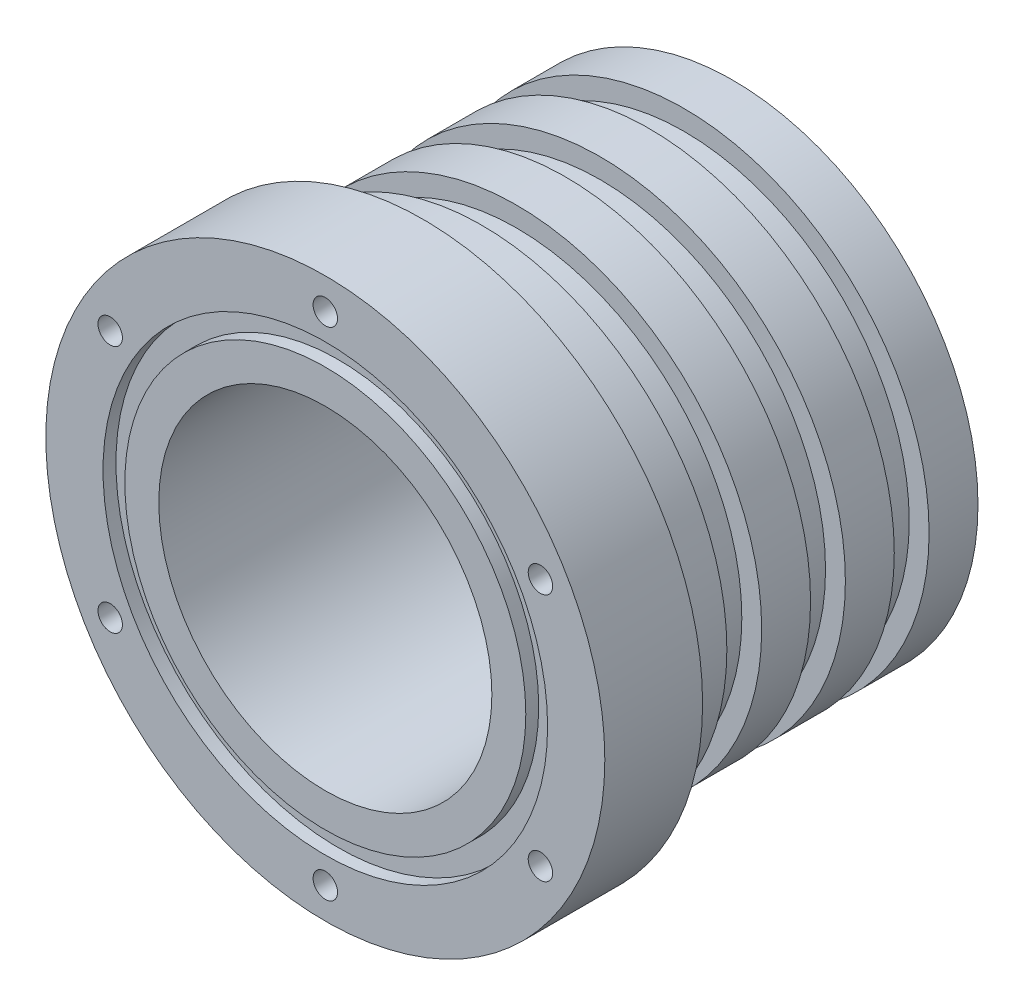
ISO-10303-21;
HEADER;
FILE_DESCRIPTION(('STEP AP214'),'2;1');
FILE_NAME('part.step','',(''),(''),'','','');
FILE_SCHEMA(('AUTOMOTIVE_DESIGN { 1 0 10303 214 1 1 1 1 }'));
ENDSEC;
DATA;
#1=APPLICATION_CONTEXT('core data for automotive mechanical design processes');
#2=APPLICATION_PROTOCOL_DEFINITION('international standard','automotive_design',2000,#1);
#3=PRODUCT_CONTEXT('',#1,'mechanical');
#4=PRODUCT('Part','Part','',(#3));
#5=PRODUCT_RELATED_PRODUCT_CATEGORY('part','',(#4));
#6=PRODUCT_DEFINITION_FORMATION('','',#4);
#7=PRODUCT_DEFINITION_CONTEXT('part definition',#1,'design');
#8=PRODUCT_DEFINITION('design','',#6,#7);
#9=PRODUCT_DEFINITION_SHAPE('','',#8);
#10=(LENGTH_UNIT() NAMED_UNIT(*) SI_UNIT(.MILLI.,.METRE.));
#11=(NAMED_UNIT(*) PLANE_ANGLE_UNIT() SI_UNIT($,.RADIAN.));
#12=(NAMED_UNIT(*) SI_UNIT($,.STERADIAN.) SOLID_ANGLE_UNIT());
#13=UNCERTAINTY_MEASURE_WITH_UNIT(LENGTH_MEASURE(1.E-05),#10,'distance_accuracy_value','');
#14=(GEOMETRIC_REPRESENTATION_CONTEXT(3) GLOBAL_UNCERTAINTY_ASSIGNED_CONTEXT((#13)) GLOBAL_UNIT_ASSIGNED_CONTEXT((#10,
#11,#12)) REPRESENTATION_CONTEXT('',''));
#15=CARTESIAN_POINT('',(0.,0.,0.));
#16=DIRECTION('',(0.,0.,1.));
#17=DIRECTION('',(1.,0.,0.));
#18=AXIS2_PLACEMENT_3D('',#15,#16,#17);
#19=CARTESIAN_POINT('',(-17.03,0.,0.));
#20=DIRECTION('',(0.,0.,-1.));
#21=DIRECTION('',(-1.,0.,0.));
#22=AXIS2_PLACEMENT_3D('',#19,#20,#21);
#23=PLANE('',#22);
#24=CARTESIAN_POINT('',(0.,0.,0.));
#25=DIRECTION('',(0.,0.,1.));
#26=DIRECTION('',(1.,0.,0.));
#27=AXIS2_PLACEMENT_3D('',#24,#25,#26);
#28=CIRCLE('',#27,17.03);
#29=CARTESIAN_POINT('',(17.03,0.,0.));
#30=VERTEX_POINT('',#29);
#31=EDGE_CURVE('E167',#30,#30,#28,.T.);
#32=ORIENTED_EDGE('',*,*,#31,.F.);
#33=EDGE_LOOP('',(#32));
#34=FACE_BOUND('',#33,.T.);
#35=CARTESIAN_POINT('',(0.,0.,0.));
#36=DIRECTION('',(0.,0.,1.));
#37=DIRECTION('',(1.,0.,0.));
#38=AXIS2_PLACEMENT_3D('',#35,#36,#37);
#39=CIRCLE('',#38,20.5);
#40=CARTESIAN_POINT('',(20.5,0.,0.));
#41=VERTEX_POINT('',#40);
#42=EDGE_CURVE('E250',#41,#41,#39,.T.);
#43=ORIENTED_EDGE('',*,*,#42,.T.);
#44=EDGE_LOOP('',(#43));
#45=FACE_BOUND('',#44,.T.);
#46=ADVANCED_FACE('F36',(#34,#45),#23,.F.);
#47=CARTESIAN_POINT('',(0.,0.,0.));
#48=DIRECTION('',(0.,0.,1.));
#49=DIRECTION('',(1.,0.,0.));
#50=AXIS2_PLACEMENT_3D('',#47,#48,#49);
#51=CIRCLE('',#50,22.73);
#52=CARTESIAN_POINT('',(22.73,0.,0.));
#53=VERTEX_POINT('',#52);
#54=EDGE_CURVE('E255',#53,#53,#51,.T.);
#55=ORIENTED_EDGE('',*,*,#54,.F.);
#56=EDGE_LOOP('',(#55));
#57=FACE_BOUND('',#56,.T.);
#58=CARTESIAN_POINT('',(0.,25.4,0.));
#59=DIRECTION('',(0.,0.,1.));
#60=DIRECTION('',(1.,0.,0.));
#61=AXIS2_PLACEMENT_3D('',#58,#59,#60);
#62=CIRCLE('',#61,1.24999999999999);
#63=CARTESIAN_POINT('',(1.24999999999999,25.4,0.));
#64=VERTEX_POINT('',#63);
#65=EDGE_CURVE('E96',#64,#64,#62,.T.);
#66=ORIENTED_EDGE('',*,*,#65,.F.);
#67=EDGE_LOOP('',(#66));
#68=FACE_BOUND('',#67,.T.);
#69=CARTESIAN_POINT('',(21.9970452561281,12.7000000000059,0.));
#70=DIRECTION('',(0.,0.,1.));
#71=DIRECTION('',(1.,0.,0.));
#72=AXIS2_PLACEMENT_3D('',#69,#70,#71);
#73=CIRCLE('',#72,1.24999999999999);
#74=CARTESIAN_POINT('',(23.2470452561281,12.7000000000059,0.));
#75=VERTEX_POINT('',#74);
#76=EDGE_CURVE('E95',#75,#75,#73,.T.);
#77=ORIENTED_EDGE('',*,*,#76,.F.);
#78=EDGE_LOOP('',(#77));
#79=FACE_BOUND('',#78,.T.);
#80=CARTESIAN_POINT('',(21.9970452561349,-12.6999999999941,0.));
#81=DIRECTION('',(0.,0.,1.));
#82=DIRECTION('',(1.,0.,0.));
#83=AXIS2_PLACEMENT_3D('',#80,#81,#82);
#84=CIRCLE('',#83,1.24999999999999);
#85=CARTESIAN_POINT('',(23.2470452561349,-12.6999999999941,0.));
#86=VERTEX_POINT('',#85);
#87=EDGE_CURVE('E268',#86,#86,#84,.T.);
#88=ORIENTED_EDGE('',*,*,#87,.F.);
#89=EDGE_LOOP('',(#88));
#90=FACE_BOUND('',#89,.T.);
#91=CARTESIAN_POINT('',(1.35308431126191E-11,-25.4,0.));
#92=DIRECTION('',(0.,0.,1.));
#93=DIRECTION('',(1.,0.,0.));
#94=AXIS2_PLACEMENT_3D('',#91,#92,#93);
#95=CIRCLE('',#94,1.24999999999999);
#96=CARTESIAN_POINT('',(1.25000000001352,-25.4,0.));
#97=VERTEX_POINT('',#96);
#98=EDGE_CURVE('E273',#97,#97,#95,.T.);
#99=ORIENTED_EDGE('',*,*,#98,.F.);
#100=EDGE_LOOP('',(#99));
#101=FACE_BOUND('',#100,.T.);
#102=CARTESIAN_POINT('',(-21.9970452561146,-12.7000000000059,0.));
#103=DIRECTION('',(0.,0.,1.));
#104=DIRECTION('',(1.,0.,0.));
#105=AXIS2_PLACEMENT_3D('',#102,#103,#104);
#106=CIRCLE('',#105,1.24999999999999);
#107=CARTESIAN_POINT('',(-20.7470452561146,-12.7000000000059,0.));
#108=VERTEX_POINT('',#107);
#109=EDGE_CURVE('E278',#108,#108,#106,.T.);
#110=ORIENTED_EDGE('',*,*,#109,.F.);
#111=EDGE_LOOP('',(#110));
#112=FACE_BOUND('',#111,.T.);
#113=CARTESIAN_POINT('',(-21.9970452561214,12.6999999999941,0.));
#114=DIRECTION('',(0.,0.,1.));
#115=DIRECTION('',(1.,0.,0.));
#116=AXIS2_PLACEMENT_3D('',#113,#114,#115);
#117=CIRCLE('',#116,1.24999999999999);
#118=CARTESIAN_POINT('',(-20.7470452561214,12.6999999999941,0.));
#119=VERTEX_POINT('',#118);
#120=EDGE_CURVE('E168',#119,#119,#117,.T.);
#121=ORIENTED_EDGE('',*,*,#120,.F.);
#122=EDGE_LOOP('',(#121));
#123=FACE_BOUND('',#122,.T.);
#124=CARTESIAN_POINT('',(0.,0.,0.));
#125=DIRECTION('',(0.,0.,1.));
#126=DIRECTION('',(1.,0.,0.));
#127=AXIS2_PLACEMENT_3D('',#124,#125,#126);
#128=CIRCLE('',#127,28.58);
#129=CARTESIAN_POINT('',(28.58,0.,0.));
#130=VERTEX_POINT('',#129);
#131=EDGE_CURVE('E122',#130,#130,#128,.T.);
#132=ORIENTED_EDGE('',*,*,#131,.T.);
#133=EDGE_LOOP('',(#132));
#134=FACE_BOUND('',#133,.T.);
#135=ADVANCED_FACE('F38',(#57,#68,#79,#90,#101,#112,#123,#134),#23,.F.);
#136=CARTESIAN_POINT('',(0.,0.,0.));
#137=DIRECTION('',(0.,0.,1.));
#138=DIRECTION('',(1.,0.,0.));
#139=AXIS2_PLACEMENT_3D('',#136,#137,#138);
#140=CYLINDRICAL_SURFACE('',#139,28.58);
#141=ORIENTED_EDGE('',*,*,#131,.F.);
#142=EDGE_LOOP('',(#141));
#143=FACE_BOUND('',#142,.T.);
#144=CARTESIAN_POINT('',(0.,0.,-10.));
#145=DIRECTION('',(0.,0.,1.));
#146=DIRECTION('',(1.,0.,0.));
#147=AXIS2_PLACEMENT_3D('',#144,#145,#146);
#148=CIRCLE('',#147,28.58);
#149=CARTESIAN_POINT('',(28.58,0.,-10.));
#150=VERTEX_POINT('',#149);
#151=EDGE_CURVE('E116',#150,#150,#148,.T.);
#152=ORIENTED_EDGE('',*,*,#151,.T.);
#153=EDGE_LOOP('',(#152));
#154=FACE_BOUND('',#153,.T.);
#155=ADVANCED_FACE('F227',(#143,#154),#140,.T.);
#156=CARTESIAN_POINT('',(-28.58,0.,-9.99999999999999));
#157=DIRECTION('',(0.,0.,1.));
#158=DIRECTION('',(1.,0.,0.));
#159=AXIS2_PLACEMENT_3D('',#156,#157,#158);
#160=PLANE('',#159);
#161=ORIENTED_EDGE('',*,*,#151,.F.);
#162=EDGE_LOOP('',(#161));
#163=FACE_BOUND('',#162,.T.);
#164=CARTESIAN_POINT('',(0.,0.,-9.99999999999999));
#165=DIRECTION('',(0.,0.,1.));
#166=DIRECTION('',(1.,0.,0.));
#167=AXIS2_PLACEMENT_3D('',#164,#165,#166);
#168=CIRCLE('',#167,25.06);
#169=CARTESIAN_POINT('',(21.080703143895,13.5501865285677,-9.99999999999999));
#170=VERTEX_POINT('',#169);
#171=CARTESIAN_POINT('',(1.19445418780827,25.0315177165354,-9.99999999999999));
#172=VERTEX_POINT('',#171);
#173=EDGE_CURVE('E104',#170,#172,#168,.T.);
#174=ORIENTED_EDGE('',*,*,#173,.T.);
#175=CARTESIAN_POINT('',(0.,25.4,-9.99999999999999));
#176=DIRECTION('',(0.,0.,1.));
#177=DIRECTION('',(1.,0.,0.));
#178=AXIS2_PLACEMENT_3D('',#175,#176,#177);
#179=CIRCLE('',#178,1.24999999999999);
#180=CARTESIAN_POINT('',(-1.19445418780825,25.0315177165354,-9.99999999999999));
#181=VERTEX_POINT('',#180);
#182=EDGE_CURVE('E11',#172,#181,#179,.T.);
#183=ORIENTED_EDGE('',*,*,#182,.T.);
#184=CARTESIAN_POINT('',(-21.0807031438966,13.5501865285651,-9.99999999999999));
#185=VERTEX_POINT('',#184);
#186=EDGE_CURVE('E105',#181,#185,#168,.T.);
#187=ORIENTED_EDGE('',*,*,#186,.T.);
#188=CARTESIAN_POINT('',(-21.9970452561214,12.6999999999941,-9.99999999999999));
#189=DIRECTION('',(0.,0.,1.));
#190=DIRECTION('',(1.,0.,0.));
#191=AXIS2_PLACEMENT_3D('',#188,#189,#190);
#192=CIRCLE('',#191,1.24999999999999);
#193=CARTESIAN_POINT('',(-22.2751573317064,11.4813311879645,-9.99999999999999));
#194=VERTEX_POINT('',#193);
#195=EDGE_CURVE('E125',#185,#194,#192,.T.);
#196=ORIENTED_EDGE('',*,*,#195,.T.);
#197=CARTESIAN_POINT('',(-22.2751573317003,-11.4813311879764,-9.99999999999999));
#198=VERTEX_POINT('',#197);
#199=EDGE_CURVE('E117',#194,#198,#168,.T.);
#200=ORIENTED_EDGE('',*,*,#199,.T.);
#201=CARTESIAN_POINT('',(-21.9970452561146,-12.7000000000059,-9.99999999999999));
#202=DIRECTION('',(0.,0.,1.));
#203=DIRECTION('',(1.,0.,0.));
#204=AXIS2_PLACEMENT_3D('',#201,#202,#203);
#205=CIRCLE('',#204,1.24999999999999);
#206=CARTESIAN_POINT('',(-21.0807031438894,-13.5501865285763,-9.99999999999999));
#207=VERTEX_POINT('',#206);
#208=EDGE_CURVE('E128',#198,#207,#205,.T.);
#209=ORIENTED_EDGE('',*,*,#208,.T.);
#210=CARTESIAN_POINT('',(-1.19445418779494,-25.0315177165361,-9.99999999999999));
#211=VERTEX_POINT('',#210);
#212=EDGE_CURVE('E148',#207,#211,#168,.T.);
#213=ORIENTED_EDGE('',*,*,#212,.T.);
#214=CARTESIAN_POINT('',(1.35308431126191E-11,-25.4,-9.99999999999999));
#215=DIRECTION('',(0.,0.,1.));
#216=DIRECTION('',(1.,0.,0.));
#217=AXIS2_PLACEMENT_3D('',#214,#215,#216);
#218=CIRCLE('',#217,1.24999999999999);
#219=CARTESIAN_POINT('',(1.19445418782159,-25.0315177165348,-9.99999999999999));
#220=VERTEX_POINT('',#219);
#221=EDGE_CURVE('E131',#211,#220,#218,.T.);
#222=ORIENTED_EDGE('',*,*,#221,.T.);
#223=CARTESIAN_POINT('',(21.0807031439022,-13.5501865285565,-9.99999999999999));
#224=VERTEX_POINT('',#223);
#225=EDGE_CURVE('E139',#220,#224,#168,.T.);
#226=ORIENTED_EDGE('',*,*,#225,.T.);
#227=CARTESIAN_POINT('',(21.9970452561349,-12.6999999999941,-9.99999999999999));
#228=DIRECTION('',(0.,0.,1.));
#229=DIRECTION('',(1.,0.,0.));
#230=AXIS2_PLACEMENT_3D('',#227,#228,#229);
#231=CIRCLE('',#230,1.24999999999999);
#232=CARTESIAN_POINT('',(22.2751573317078,-11.4813311879618,-9.99999999999999));
#233=VERTEX_POINT('',#232);
#234=EDGE_CURVE('E134',#224,#233,#231,.T.);
#235=ORIENTED_EDGE('',*,*,#234,.T.);
#236=CARTESIAN_POINT('',(22.2751573317017,11.4813311879736,-9.99999999999999));
#237=VERTEX_POINT('',#236);
#238=EDGE_CURVE('E111',#233,#237,#168,.T.);
#239=ORIENTED_EDGE('',*,*,#238,.T.);
#240=CARTESIAN_POINT('',(21.9970452561281,12.7000000000059,-9.99999999999999));
#241=DIRECTION('',(0.,0.,1.));
#242=DIRECTION('',(1.,0.,0.));
#243=AXIS2_PLACEMENT_3D('',#240,#241,#242);
#244=CIRCLE('',#243,1.24999999999999);
#245=EDGE_CURVE('E44',#237,#170,#244,.T.);
#246=ORIENTED_EDGE('',*,*,#245,.T.);
#247=EDGE_LOOP('',(#174,#183,#187,#196,#200,#209,#213,#222,#226,#235,#239,#246));
#248=FACE_BOUND('',#247,.T.);
#249=ADVANCED_FACE('F108',(#163,#248),#160,.F.);
#250=CARTESIAN_POINT('',(0.,0.,0.));
#251=DIRECTION('',(0.,0.,1.));
#252=DIRECTION('',(1.,0.,0.));
#253=AXIS2_PLACEMENT_3D('',#250,#251,#252);
#254=CYLINDRICAL_SURFACE('',#253,25.06);
#255=EDGE_CURVE('E112',#185,#194,#168,.T.);
#256=ORIENTED_EDGE('',*,*,#255,.F.);
#257=ORIENTED_EDGE('',*,*,#186,.F.);
#258=EDGE_CURVE('E94',#172,#181,#168,.T.);
#259=ORIENTED_EDGE('',*,*,#258,.F.);
#260=ORIENTED_EDGE('',*,*,#173,.F.);
#261=EDGE_CURVE('E110',#237,#170,#168,.T.);
#262=ORIENTED_EDGE('',*,*,#261,.F.);
#263=ORIENTED_EDGE('',*,*,#238,.F.);
#264=EDGE_CURVE('E144',#224,#233,#168,.T.);
#265=ORIENTED_EDGE('',*,*,#264,.F.);
#266=ORIENTED_EDGE('',*,*,#225,.F.);
#267=EDGE_CURVE('E146',#211,#220,#168,.T.);
#268=ORIENTED_EDGE('',*,*,#267,.F.);
#269=ORIENTED_EDGE('',*,*,#212,.F.);
#270=EDGE_CURVE('E153',#198,#207,#168,.T.);
#271=ORIENTED_EDGE('',*,*,#270,.F.);
#272=ORIENTED_EDGE('',*,*,#199,.F.);
#273=EDGE_LOOP('',(#256,#257,#259,#260,#262,#263,#265,#266,#268,#269,#271,#272));
#274=FACE_BOUND('',#273,.T.);
#275=CARTESIAN_POINT('',(0.,0.,-16.));
#276=DIRECTION('',(0.,0.,1.));
#277=DIRECTION('',(1.,0.,0.));
#278=AXIS2_PLACEMENT_3D('',#275,#276,#277);
#279=CIRCLE('',#278,25.06);
#280=CARTESIAN_POINT('',(25.06,0.,-16.));
#281=VERTEX_POINT('',#280);
#282=EDGE_CURVE('E118',#281,#281,#279,.T.);
#283=ORIENTED_EDGE('',*,*,#282,.T.);
#284=EDGE_LOOP('',(#283));
#285=FACE_BOUND('',#284,.T.);
#286=ADVANCED_FACE('F101',(#274,#285),#254,.T.);
#287=CARTESIAN_POINT('',(-25.06,0.,-16.));
#288=DIRECTION('',(0.,0.,1.));
#289=DIRECTION('',(1.,0.,0.));
#290=AXIS2_PLACEMENT_3D('',#287,#288,#289);
#291=PLANE('',#290);
#292=ORIENTED_EDGE('',*,*,#282,.F.);
#293=EDGE_LOOP('',(#292));
#294=FACE_BOUND('',#293,.T.);
#295=CARTESIAN_POINT('',(0.,0.,-16.));
#296=DIRECTION('',(0.,0.,1.));
#297=DIRECTION('',(1.,0.,0.));
#298=AXIS2_PLACEMENT_3D('',#295,#296,#297);
#299=CIRCLE('',#298,23.03);
#300=CARTESIAN_POINT('',(23.03,0.,-16.));
#301=VERTEX_POINT('',#300);
#302=EDGE_CURVE('E212',#301,#301,#299,.T.);
#303=ORIENTED_EDGE('',*,*,#302,.T.);
#304=EDGE_LOOP('',(#303));
#305=FACE_BOUND('',#304,.T.);
#306=ADVANCED_FACE('F240',(#294,#305),#291,.F.);
#307=CARTESIAN_POINT('',(0.,0.,0.));
#308=DIRECTION('',(0.,0.,1.));
#309=DIRECTION('',(1.,0.,0.));
#310=AXIS2_PLACEMENT_3D('',#307,#308,#309);
#311=CYLINDRICAL_SURFACE('',#310,23.03);
#312=ORIENTED_EDGE('',*,*,#302,.F.);
#313=EDGE_LOOP('',(#312));
#314=FACE_BOUND('',#313,.T.);
#315=CARTESIAN_POINT('',(0.,0.,-19.56));
#316=DIRECTION('',(0.,0.,1.));
#317=DIRECTION('',(1.,0.,0.));
#318=AXIS2_PLACEMENT_3D('',#315,#316,#317);
#319=CIRCLE('',#318,23.03);
#320=CARTESIAN_POINT('',(23.03,0.,-19.56));
#321=VERTEX_POINT('',#320);
#322=EDGE_CURVE('E210',#321,#321,#319,.T.);
#323=ORIENTED_EDGE('',*,*,#322,.T.);
#324=EDGE_LOOP('',(#323));
#325=FACE_BOUND('',#324,.T.);
#326=ADVANCED_FACE('F343',(#314,#325),#311,.T.);
#327=CARTESIAN_POINT('',(-23.03,0.,-19.56));
#328=DIRECTION('',(0.,0.,-1.));
#329=DIRECTION('',(-1.,0.,0.));
#330=AXIS2_PLACEMENT_3D('',#327,#328,#329);
#331=PLANE('',#330);
#332=ORIENTED_EDGE('',*,*,#322,.F.);
#333=EDGE_LOOP('',(#332));
#334=FACE_BOUND('',#333,.T.);
#335=CARTESIAN_POINT('',(0.,0.,-19.56));
#336=DIRECTION('',(0.,0.,1.));
#337=DIRECTION('',(1.,0.,0.));
#338=AXIS2_PLACEMENT_3D('',#335,#336,#337);
#339=CIRCLE('',#338,25.06);
#340=CARTESIAN_POINT('',(25.06,0.,-19.56));
#341=VERTEX_POINT('',#340);
#342=EDGE_CURVE('E207',#341,#341,#339,.T.);
#343=ORIENTED_EDGE('',*,*,#342,.T.);
#344=EDGE_LOOP('',(#343));
#345=FACE_BOUND('',#344,.T.);
#346=ADVANCED_FACE('F339',(#334,#345),#331,.F.);
#347=CARTESIAN_POINT('',(0.,0.,0.));
#348=DIRECTION('',(0.,0.,1.));
#349=DIRECTION('',(1.,0.,0.));
#350=AXIS2_PLACEMENT_3D('',#347,#348,#349);
#351=CYLINDRICAL_SURFACE('',#350,25.06);
#352=ORIENTED_EDGE('',*,*,#342,.F.);
#353=EDGE_LOOP('',(#352));
#354=FACE_BOUND('',#353,.T.);
#355=CARTESIAN_POINT('',(0.,0.,-24.56));
#356=DIRECTION('',(0.,0.,1.));
#357=DIRECTION('',(1.,0.,0.));
#358=AXIS2_PLACEMENT_3D('',#355,#356,#357);
#359=CIRCLE('',#358,25.06);
#360=CARTESIAN_POINT('',(25.06,0.,-24.56));
#361=VERTEX_POINT('',#360);
#362=EDGE_CURVE('E204',#361,#361,#359,.T.);
#363=ORIENTED_EDGE('',*,*,#362,.T.);
#364=EDGE_LOOP('',(#363));
#365=FACE_BOUND('',#364,.T.);
#366=ADVANCED_FACE('F335',(#354,#365),#351,.T.);
#367=CARTESIAN_POINT('',(-25.06,0.,-24.56));
#368=DIRECTION('',(0.,0.,1.));
#369=DIRECTION('',(1.,0.,0.));
#370=AXIS2_PLACEMENT_3D('',#367,#368,#369);
#371=PLANE('',#370);
#372=ORIENTED_EDGE('',*,*,#362,.F.);
#373=EDGE_LOOP('',(#372));
#374=FACE_BOUND('',#373,.T.);
#375=CARTESIAN_POINT('',(0.,0.,-24.56));
#376=DIRECTION('',(0.,0.,1.));
#377=DIRECTION('',(1.,0.,0.));
#378=AXIS2_PLACEMENT_3D('',#375,#376,#377);
#379=CIRCLE('',#378,23.03);
#380=CARTESIAN_POINT('',(23.03,0.,-24.56));
#381=VERTEX_POINT('',#380);
#382=EDGE_CURVE('E201',#381,#381,#379,.T.);
#383=ORIENTED_EDGE('',*,*,#382,.T.);
#384=EDGE_LOOP('',(#383));
#385=FACE_BOUND('',#384,.T.);
#386=ADVANCED_FACE('F331',(#374,#385),#371,.F.);
#387=CARTESIAN_POINT('',(0.,0.,0.));
#388=DIRECTION('',(0.,0.,1.));
#389=DIRECTION('',(1.,0.,0.));
#390=AXIS2_PLACEMENT_3D('',#387,#388,#389);
#391=CYLINDRICAL_SURFACE('',#390,23.03);
#392=ORIENTED_EDGE('',*,*,#382,.F.);
#393=EDGE_LOOP('',(#392));
#394=FACE_BOUND('',#393,.T.);
#395=CARTESIAN_POINT('',(0.,0.,-28.12));
#396=DIRECTION('',(0.,0.,1.));
#397=DIRECTION('',(1.,0.,0.));
#398=AXIS2_PLACEMENT_3D('',#395,#396,#397);
#399=CIRCLE('',#398,23.03);
#400=CARTESIAN_POINT('',(23.03,0.,-28.12));
#401=VERTEX_POINT('',#400);
#402=EDGE_CURVE('E198',#401,#401,#399,.T.);
#403=ORIENTED_EDGE('',*,*,#402,.T.);
#404=EDGE_LOOP('',(#403));
#405=FACE_BOUND('',#404,.T.);
#406=ADVANCED_FACE('F327',(#394,#405),#391,.T.);
#407=CARTESIAN_POINT('',(-23.03,0.,-28.12));
#408=DIRECTION('',(0.,0.,-1.));
#409=DIRECTION('',(-1.,0.,0.));
#410=AXIS2_PLACEMENT_3D('',#407,#408,#409);
#411=PLANE('',#410);
#412=ORIENTED_EDGE('',*,*,#402,.F.);
#413=EDGE_LOOP('',(#412));
#414=FACE_BOUND('',#413,.T.);
#415=CARTESIAN_POINT('',(0.,0.,-28.12));
#416=DIRECTION('',(0.,0.,1.));
#417=DIRECTION('',(1.,0.,0.));
#418=AXIS2_PLACEMENT_3D('',#415,#416,#417);
#419=CIRCLE('',#418,25.06);
#420=CARTESIAN_POINT('',(25.06,0.,-28.12));
#421=VERTEX_POINT('',#420);
#422=EDGE_CURVE('E195',#421,#421,#419,.T.);
#423=ORIENTED_EDGE('',*,*,#422,.T.);
#424=EDGE_LOOP('',(#423));
#425=FACE_BOUND('',#424,.T.);
#426=ADVANCED_FACE('F323',(#414,#425),#411,.F.);
#427=CARTESIAN_POINT('',(0.,0.,0.));
#428=DIRECTION('',(0.,0.,1.));
#429=DIRECTION('',(1.,0.,0.));
#430=AXIS2_PLACEMENT_3D('',#427,#428,#429);
#431=CYLINDRICAL_SURFACE('',#430,25.06);
#432=ORIENTED_EDGE('',*,*,#422,.F.);
#433=EDGE_LOOP('',(#432));
#434=FACE_BOUND('',#433,.T.);
#435=CARTESIAN_POINT('',(0.,0.,-33.12));
#436=DIRECTION('',(0.,0.,1.));
#437=DIRECTION('',(1.,0.,0.));
#438=AXIS2_PLACEMENT_3D('',#435,#436,#437);
#439=CIRCLE('',#438,25.06);
#440=CARTESIAN_POINT('',(25.06,0.,-33.12));
#441=VERTEX_POINT('',#440);
#442=EDGE_CURVE('E192',#441,#441,#439,.T.);
#443=ORIENTED_EDGE('',*,*,#442,.T.);
#444=EDGE_LOOP('',(#443));
#445=FACE_BOUND('',#444,.T.);
#446=ADVANCED_FACE('F319',(#434,#445),#431,.T.);
#447=CARTESIAN_POINT('',(-25.06,0.,-33.12));
#448=DIRECTION('',(0.,0.,1.));
#449=DIRECTION('',(1.,0.,0.));
#450=AXIS2_PLACEMENT_3D('',#447,#448,#449);
#451=PLANE('',#450);
#452=ORIENTED_EDGE('',*,*,#442,.F.);
#453=EDGE_LOOP('',(#452));
#454=FACE_BOUND('',#453,.T.);
#455=CARTESIAN_POINT('',(0.,0.,-33.12));
#456=DIRECTION('',(0.,0.,1.));
#457=DIRECTION('',(1.,0.,0.));
#458=AXIS2_PLACEMENT_3D('',#455,#456,#457);
#459=CIRCLE('',#458,23.03);
#460=CARTESIAN_POINT('',(23.03,0.,-33.12));
#461=VERTEX_POINT('',#460);
#462=EDGE_CURVE('E189',#461,#461,#459,.T.);
#463=ORIENTED_EDGE('',*,*,#462,.T.);
#464=EDGE_LOOP('',(#463));
#465=FACE_BOUND('',#464,.T.);
#466=ADVANCED_FACE('F315',(#454,#465),#451,.F.);
#467=CARTESIAN_POINT('',(0.,0.,0.));
#468=DIRECTION('',(0.,0.,1.));
#469=DIRECTION('',(1.,0.,0.));
#470=AXIS2_PLACEMENT_3D('',#467,#468,#469);
#471=CYLINDRICAL_SURFACE('',#470,23.03);
#472=ORIENTED_EDGE('',*,*,#462,.F.);
#473=EDGE_LOOP('',(#472));
#474=FACE_BOUND('',#473,.T.);
#475=CARTESIAN_POINT('',(0.,0.,-36.68));
#476=DIRECTION('',(0.,0.,1.));
#477=DIRECTION('',(1.,0.,0.));
#478=AXIS2_PLACEMENT_3D('',#475,#476,#477);
#479=CIRCLE('',#478,23.03);
#480=CARTESIAN_POINT('',(23.03,0.,-36.68));
#481=VERTEX_POINT('',#480);
#482=EDGE_CURVE('E186',#481,#481,#479,.T.);
#483=ORIENTED_EDGE('',*,*,#482,.T.);
#484=EDGE_LOOP('',(#483));
#485=FACE_BOUND('',#484,.T.);
#486=ADVANCED_FACE('F311',(#474,#485),#471,.T.);
#487=CARTESIAN_POINT('',(-23.03,0.,-36.68));
#488=DIRECTION('',(0.,0.,-1.));
#489=DIRECTION('',(-1.,0.,0.));
#490=AXIS2_PLACEMENT_3D('',#487,#488,#489);
#491=PLANE('',#490);
#492=ORIENTED_EDGE('',*,*,#482,.F.);
#493=EDGE_LOOP('',(#492));
#494=FACE_BOUND('',#493,.T.);
#495=CARTESIAN_POINT('',(0.,0.,-36.68));
#496=DIRECTION('',(0.,0.,1.));
#497=DIRECTION('',(1.,0.,0.));
#498=AXIS2_PLACEMENT_3D('',#495,#496,#497);
#499=CIRCLE('',#498,25.06);
#500=CARTESIAN_POINT('',(25.06,0.,-36.68));
#501=VERTEX_POINT('',#500);
#502=EDGE_CURVE('E183',#501,#501,#499,.T.);
#503=ORIENTED_EDGE('',*,*,#502,.T.);
#504=EDGE_LOOP('',(#503));
#505=FACE_BOUND('',#504,.T.);
#506=ADVANCED_FACE('F307',(#494,#505),#491,.F.);
#507=CARTESIAN_POINT('',(0.,0.,0.));
#508=DIRECTION('',(0.,0.,1.));
#509=DIRECTION('',(1.,0.,0.));
#510=AXIS2_PLACEMENT_3D('',#507,#508,#509);
#511=CYLINDRICAL_SURFACE('',#510,25.06);
#512=ORIENTED_EDGE('',*,*,#502,.F.);
#513=EDGE_LOOP('',(#512));
#514=FACE_BOUND('',#513,.T.);
#515=CARTESIAN_POINT('',(0.,0.,-41.68));
#516=DIRECTION('',(0.,0.,1.));
#517=DIRECTION('',(1.,0.,0.));
#518=AXIS2_PLACEMENT_3D('',#515,#516,#517);
#519=CIRCLE('',#518,25.06);
#520=CARTESIAN_POINT('',(25.06,0.,-41.68));
#521=VERTEX_POINT('',#520);
#522=EDGE_CURVE('E180',#521,#521,#519,.T.);
#523=ORIENTED_EDGE('',*,*,#522,.T.);
#524=EDGE_LOOP('',(#523));
#525=FACE_BOUND('',#524,.T.);
#526=ADVANCED_FACE('F303',(#514,#525),#511,.T.);
#527=CARTESIAN_POINT('',(-25.06,0.,-41.68));
#528=DIRECTION('',(0.,0.,1.));
#529=DIRECTION('',(1.,0.,0.));
#530=AXIS2_PLACEMENT_3D('',#527,#528,#529);
#531=PLANE('',#530);
#532=ORIENTED_EDGE('',*,*,#522,.F.);
#533=EDGE_LOOP('',(#532));
#534=FACE_BOUND('',#533,.T.);
#535=CARTESIAN_POINT('',(0.,0.,-41.68));
#536=DIRECTION('',(0.,0.,1.));
#537=DIRECTION('',(1.,0.,0.));
#538=AXIS2_PLACEMENT_3D('',#535,#536,#537);
#539=CIRCLE('',#538,17.03);
#540=CARTESIAN_POINT('',(17.03,0.,-41.68));
#541=VERTEX_POINT('',#540);
#542=EDGE_CURVE('E171',#541,#541,#539,.T.);
#543=ORIENTED_EDGE('',*,*,#542,.T.);
#544=EDGE_LOOP('',(#543));
#545=FACE_BOUND('',#544,.T.);
#546=ADVANCED_FACE('F299',(#534,#545),#531,.F.);
#547=CARTESIAN_POINT('',(0.,0.,0.));
#548=DIRECTION('',(0.,0.,1.));
#549=DIRECTION('',(1.,0.,0.));
#550=AXIS2_PLACEMENT_3D('',#547,#548,#549);
#551=CYLINDRICAL_SURFACE('',#550,17.03);
#552=ORIENTED_EDGE('',*,*,#542,.F.);
#553=EDGE_LOOP('',(#552));
#554=FACE_BOUND('',#553,.T.);
#555=ORIENTED_EDGE('',*,*,#31,.T.);
#556=EDGE_LOOP('',(#555));
#557=FACE_BOUND('',#556,.T.);
#558=ADVANCED_FACE('F295',(#554,#557),#551,.F.);
#559=CARTESIAN_POINT('',(-28.58,0.,-9.99999999999999));
#560=DIRECTION('',(0.,0.,1.));
#561=DIRECTION('',(1.,0.,0.));
#562=AXIS2_PLACEMENT_3D('',#559,#560,#561);
#563=PLANE('',#562);
#564=ORIENTED_EDGE('',*,*,#255,.T.);
#565=CARTESIAN_POINT('',(-21.9970452561214,12.6999999999941,-9.99999999999999));
#566=DIRECTION('',(0.,0.,1.));
#567=DIRECTION('',(1.,0.,0.));
#568=AXIS2_PLACEMENT_3D('',#565,#566,#567);
#569=CIRCLE('',#568,1.24999999999999);
#570=EDGE_CURVE('E165',#185,#194,#569,.F.);
#571=ORIENTED_EDGE('',*,*,#570,.F.);
#572=EDGE_LOOP('',(#564,#571));
#573=FACE_BOUND('',#572,.T.);
#574=ADVANCED_FACE('F164',(#573),#563,.T.);
#575=CARTESIAN_POINT('',(-21.9970452561214,12.6999999999941,0.));
#576=DIRECTION('',(0.,0.,1.));
#577=DIRECTION('',(1.,0.,0.));
#578=AXIS2_PLACEMENT_3D('',#575,#576,#577);
#579=CYLINDRICAL_SURFACE('',#578,1.24999999999999);
#580=ORIENTED_EDGE('',*,*,#570,.T.);
#581=ORIENTED_EDGE('',*,*,#195,.F.);
#582=EDGE_LOOP('',(#580,#581));
#583=FACE_BOUND('',#582,.T.);
#584=ORIENTED_EDGE('',*,*,#120,.T.);
#585=EDGE_LOOP('',(#584));
#586=FACE_BOUND('',#585,.T.);
#587=ADVANCED_FACE('F218',(#583,#586),#579,.F.);
#588=CARTESIAN_POINT('',(-28.58,0.,-9.99999999999999));
#589=DIRECTION('',(0.,0.,1.));
#590=DIRECTION('',(1.,0.,0.));
#591=AXIS2_PLACEMENT_3D('',#588,#589,#590);
#592=PLANE('',#591);
#593=ORIENTED_EDGE('',*,*,#270,.T.);
#594=CARTESIAN_POINT('',(-21.9970452561146,-12.7000000000059,-9.99999999999999));
#595=DIRECTION('',(0.,0.,1.));
#596=DIRECTION('',(1.,0.,0.));
#597=AXIS2_PLACEMENT_3D('',#594,#595,#596);
#598=CIRCLE('',#597,1.24999999999999);
#599=EDGE_CURVE('E174',#198,#207,#598,.F.);
#600=ORIENTED_EDGE('',*,*,#599,.F.);
#601=EDGE_LOOP('',(#593,#600));
#602=FACE_BOUND('',#601,.T.);
#603=ADVANCED_FACE('F221',(#602),#592,.T.);
#604=CARTESIAN_POINT('',(-21.9970452561146,-12.7000000000059,0.));
#605=DIRECTION('',(0.,0.,1.));
#606=DIRECTION('',(1.,0.,0.));
#607=AXIS2_PLACEMENT_3D('',#604,#605,#606);
#608=CYLINDRICAL_SURFACE('',#607,1.24999999999999);
#609=ORIENTED_EDGE('',*,*,#599,.T.);
#610=ORIENTED_EDGE('',*,*,#208,.F.);
#611=EDGE_LOOP('',(#609,#610));
#612=FACE_BOUND('',#611,.T.);
#613=ORIENTED_EDGE('',*,*,#109,.T.);
#614=EDGE_LOOP('',(#613));
#615=FACE_BOUND('',#614,.T.);
#616=ADVANCED_FACE('F281',(#612,#615),#608,.F.);
#617=CARTESIAN_POINT('',(-28.58,0.,-9.99999999999999));
#618=DIRECTION('',(0.,0.,1.));
#619=DIRECTION('',(1.,0.,0.));
#620=AXIS2_PLACEMENT_3D('',#617,#618,#619);
#621=PLANE('',#620);
#622=ORIENTED_EDGE('',*,*,#267,.T.);
#623=CARTESIAN_POINT('',(1.35308431126191E-11,-25.4,-9.99999999999999));
#624=DIRECTION('',(0.,0.,1.));
#625=DIRECTION('',(1.,0.,0.));
#626=AXIS2_PLACEMENT_3D('',#623,#624,#625);
#627=CIRCLE('',#626,1.24999999999999);
#628=EDGE_CURVE('E276',#211,#220,#627,.F.);
#629=ORIENTED_EDGE('',*,*,#628,.F.);
#630=EDGE_LOOP('',(#622,#629));
#631=FACE_BOUND('',#630,.T.);
#632=ADVANCED_FACE('F288',(#631),#621,.T.);
#633=CARTESIAN_POINT('',(1.35308431126191E-11,-25.4,0.));
#634=DIRECTION('',(0.,0.,1.));
#635=DIRECTION('',(1.,0.,0.));
#636=AXIS2_PLACEMENT_3D('',#633,#634,#635);
#637=CYLINDRICAL_SURFACE('',#636,1.24999999999999);
#638=ORIENTED_EDGE('',*,*,#628,.T.);
#639=ORIENTED_EDGE('',*,*,#221,.F.);
#640=EDGE_LOOP('',(#638,#639));
#641=FACE_BOUND('',#640,.T.);
#642=ORIENTED_EDGE('',*,*,#98,.T.);
#643=EDGE_LOOP('',(#642));
#644=FACE_BOUND('',#643,.T.);
#645=ADVANCED_FACE('F291',(#641,#644),#637,.F.);
#646=CARTESIAN_POINT('',(-28.58,0.,-9.99999999999999));
#647=DIRECTION('',(0.,0.,1.));
#648=DIRECTION('',(1.,0.,0.));
#649=AXIS2_PLACEMENT_3D('',#646,#647,#648);
#650=PLANE('',#649);
#651=ORIENTED_EDGE('',*,*,#264,.T.);
#652=CARTESIAN_POINT('',(21.9970452561349,-12.6999999999941,-9.99999999999999));
#653=DIRECTION('',(0.,0.,1.));
#654=DIRECTION('',(1.,0.,0.));
#655=AXIS2_PLACEMENT_3D('',#652,#653,#654);
#656=CIRCLE('',#655,1.24999999999999);
#657=EDGE_CURVE('E271',#224,#233,#656,.F.);
#658=ORIENTED_EDGE('',*,*,#657,.F.);
#659=EDGE_LOOP('',(#651,#658));
#660=FACE_BOUND('',#659,.T.);
#661=ADVANCED_FACE('F432',(#660),#650,.T.);
#662=CARTESIAN_POINT('',(21.9970452561349,-12.6999999999941,0.));
#663=DIRECTION('',(0.,0.,1.));
#664=DIRECTION('',(1.,0.,0.));
#665=AXIS2_PLACEMENT_3D('',#662,#663,#664);
#666=CYLINDRICAL_SURFACE('',#665,1.24999999999999);
#667=ORIENTED_EDGE('',*,*,#657,.T.);
#668=ORIENTED_EDGE('',*,*,#234,.F.);
#669=EDGE_LOOP('',(#667,#668));
#670=FACE_BOUND('',#669,.T.);
#671=ORIENTED_EDGE('',*,*,#87,.T.);
#672=EDGE_LOOP('',(#671));
#673=FACE_BOUND('',#672,.T.);
#674=ADVANCED_FACE('F439',(#670,#673),#666,.F.);
#675=CARTESIAN_POINT('',(-28.58,0.,-9.99999999999999));
#676=DIRECTION('',(0.,0.,1.));
#677=DIRECTION('',(1.,0.,0.));
#678=AXIS2_PLACEMENT_3D('',#675,#676,#677);
#679=PLANE('',#678);
#680=ORIENTED_EDGE('',*,*,#261,.T.);
#681=CARTESIAN_POINT('',(21.9970452561281,12.7000000000059,-9.99999999999999));
#682=DIRECTION('',(0.,0.,1.));
#683=DIRECTION('',(1.,0.,0.));
#684=AXIS2_PLACEMENT_3D('',#681,#682,#683);
#685=CIRCLE('',#684,1.24999999999999);
#686=EDGE_CURVE('E57',#237,#170,#685,.F.);
#687=ORIENTED_EDGE('',*,*,#686,.F.);
#688=EDGE_LOOP('',(#680,#687));
#689=FACE_BOUND('',#688,.T.);
#690=ADVANCED_FACE('F444',(#689),#679,.T.);
#691=CARTESIAN_POINT('',(21.9970452561281,12.7000000000059,0.));
#692=DIRECTION('',(0.,0.,1.));
#693=DIRECTION('',(1.,0.,0.));
#694=AXIS2_PLACEMENT_3D('',#691,#692,#693);
#695=CYLINDRICAL_SURFACE('',#694,1.24999999999999);
#696=ORIENTED_EDGE('',*,*,#686,.T.);
#697=ORIENTED_EDGE('',*,*,#245,.F.);
#698=EDGE_LOOP('',(#696,#697));
#699=FACE_BOUND('',#698,.T.);
#700=ORIENTED_EDGE('',*,*,#76,.T.);
#701=EDGE_LOOP('',(#700));
#702=FACE_BOUND('',#701,.T.);
#703=ADVANCED_FACE('F451',(#699,#702),#695,.F.);
#704=CARTESIAN_POINT('',(-28.58,0.,-9.99999999999999));
#705=DIRECTION('',(0.,0.,1.));
#706=DIRECTION('',(1.,0.,0.));
#707=AXIS2_PLACEMENT_3D('',#704,#705,#706);
#708=PLANE('',#707);
#709=ORIENTED_EDGE('',*,*,#258,.T.);
#710=CARTESIAN_POINT('',(0.,25.4,-9.99999999999999));
#711=DIRECTION('',(0.,0.,1.));
#712=DIRECTION('',(1.,0.,0.));
#713=AXIS2_PLACEMENT_3D('',#710,#711,#712);
#714=CIRCLE('',#713,1.24999999999999);
#715=EDGE_CURVE('E50',#172,#181,#714,.F.);
#716=ORIENTED_EDGE('',*,*,#715,.F.);
#717=EDGE_LOOP('',(#709,#716));
#718=FACE_BOUND('',#717,.T.);
#719=ADVANCED_FACE('F93',(#718),#708,.T.);
#720=CARTESIAN_POINT('',(0.,25.4,0.));
#721=DIRECTION('',(0.,0.,1.));
#722=DIRECTION('',(1.,0.,0.));
#723=AXIS2_PLACEMENT_3D('',#720,#721,#722);
#724=CYLINDRICAL_SURFACE('',#723,1.24999999999999);
#725=ORIENTED_EDGE('',*,*,#715,.T.);
#726=ORIENTED_EDGE('',*,*,#182,.F.);
#727=EDGE_LOOP('',(#725,#726));
#728=FACE_BOUND('',#727,.T.);
#729=ORIENTED_EDGE('',*,*,#65,.T.);
#730=EDGE_LOOP('',(#729));
#731=FACE_BOUND('',#730,.T.);
#732=ADVANCED_FACE('F86',(#728,#731),#724,.F.);
#733=CARTESIAN_POINT('',(0.,0.,-1.32));
#734=DIRECTION('',(0.,0.,1.));
#735=DIRECTION('',(1.,0.,0.));
#736=AXIS2_PLACEMENT_3D('',#733,#734,#735);
#737=CYLINDRICAL_SURFACE('',#736,22.73);
#738=CARTESIAN_POINT('',(0.,0.,-1.32));
#739=DIRECTION('',(0.,0.,1.));
#740=DIRECTION('',(1.,0.,0.));
#741=AXIS2_PLACEMENT_3D('',#738,#739,#740);
#742=CIRCLE('',#741,22.73);
#743=CARTESIAN_POINT('',(22.73,0.,-1.32));
#744=VERTEX_POINT('',#743);
#745=EDGE_CURVE('E258',#744,#744,#742,.T.);
#746=ORIENTED_EDGE('',*,*,#745,.F.);
#747=EDGE_LOOP('',(#746));
#748=FACE_BOUND('',#747,.T.);
#749=ORIENTED_EDGE('',*,*,#54,.T.);
#750=EDGE_LOOP('',(#749));
#751=FACE_BOUND('',#750,.T.);
#752=ADVANCED_FACE('F465',(#748,#751),#737,.F.);
#753=CARTESIAN_POINT('',(0.,0.,-1.32));
#754=DIRECTION('',(0.,0.,1.));
#755=DIRECTION('',(1.,0.,0.));
#756=AXIS2_PLACEMENT_3D('',#753,#754,#755);
#757=PLANE('',#756);
#758=CARTESIAN_POINT('',(0.,0.,-1.32));
#759=DIRECTION('',(0.,0.,1.));
#760=DIRECTION('',(1.,0.,0.));
#761=AXIS2_PLACEMENT_3D('',#758,#759,#760);
#762=CIRCLE('',#761,20.5);
#763=CARTESIAN_POINT('',(20.5,0.,-1.32));
#764=VERTEX_POINT('',#763);
#765=EDGE_CURVE('E252',#764,#764,#762,.T.);
#766=ORIENTED_EDGE('',*,*,#765,.F.);
#767=EDGE_LOOP('',(#766));
#768=FACE_BOUND('',#767,.T.);
#769=ORIENTED_EDGE('',*,*,#745,.T.);
#770=EDGE_LOOP('',(#769));
#771=FACE_BOUND('',#770,.T.);
#772=ADVANCED_FACE('F475',(#768,#771),#757,.T.);
#773=CARTESIAN_POINT('',(0.,0.,-1.32));
#774=DIRECTION('',(0.,0.,1.));
#775=DIRECTION('',(1.,0.,0.));
#776=AXIS2_PLACEMENT_3D('',#773,#774,#775);
#777=CYLINDRICAL_SURFACE('',#776,20.5);
#778=ORIENTED_EDGE('',*,*,#765,.T.);
#779=EDGE_LOOP('',(#778));
#780=FACE_BOUND('',#779,.T.);
#781=ORIENTED_EDGE('',*,*,#42,.F.);
#782=EDGE_LOOP('',(#781));
#783=FACE_BOUND('',#782,.T.);
#784=ADVANCED_FACE('F484',(#780,#783),#777,.T.);
#785=CLOSED_SHELL('',(#46,#135,#155,#249,#286,#306,#326,#346,#366,#386,#406,#426,#446,#466,#486,
#506,#526,#546,#558,#574,#587,#603,#616,#632,#645,#661,#674,#690,#703,#719,#732,#752,#772,#784));
#786=MANIFOLD_SOLID_BREP('B2',#785);
#787=ADVANCED_BREP_SHAPE_REPRESENTATION('',(#18,#786),#14);
#788=SHAPE_DEFINITION_REPRESENTATION(#9,#787);
ENDSEC;
END-ISO-10303-21;
